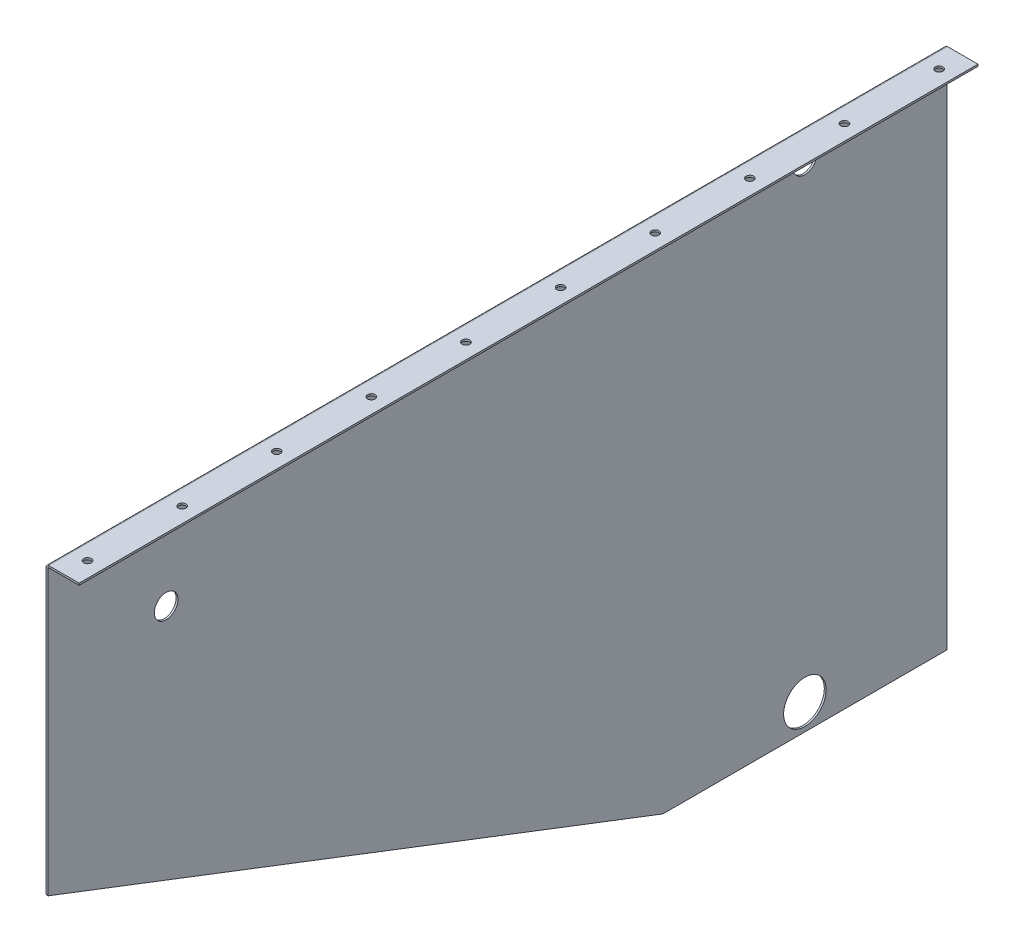
ISO-10303-21;
HEADER;
FILE_DESCRIPTION(('STEP AP214'),'2;1');
FILE_NAME('part.step','',(''),(''),'','','');
FILE_SCHEMA(('AUTOMOTIVE_DESIGN { 1 0 10303 214 1 1 1 1 }'));
ENDSEC;
DATA;
#1=APPLICATION_CONTEXT('core data for automotive mechanical design processes');
#2=APPLICATION_PROTOCOL_DEFINITION('international standard','automotive_design',2000,#1);
#3=PRODUCT_CONTEXT('',#1,'mechanical');
#4=PRODUCT('Part','Part','',(#3));
#5=PRODUCT_RELATED_PRODUCT_CATEGORY('part','',(#4));
#6=PRODUCT_DEFINITION_FORMATION('','',#4);
#7=PRODUCT_DEFINITION_CONTEXT('part definition',#1,'design');
#8=PRODUCT_DEFINITION('design','',#6,#7);
#9=PRODUCT_DEFINITION_SHAPE('','',#8);
#10=(LENGTH_UNIT() NAMED_UNIT(*) SI_UNIT(.MILLI.,.METRE.));
#11=(NAMED_UNIT(*) PLANE_ANGLE_UNIT() SI_UNIT($,.RADIAN.));
#12=(NAMED_UNIT(*) SI_UNIT($,.STERADIAN.) SOLID_ANGLE_UNIT());
#13=UNCERTAINTY_MEASURE_WITH_UNIT(LENGTH_MEASURE(1.E-05),#10,'distance_accuracy_value','');
#14=(GEOMETRIC_REPRESENTATION_CONTEXT(3) GLOBAL_UNCERTAINTY_ASSIGNED_CONTEXT((#13)) GLOBAL_UNIT_ASSIGNED_CONTEXT((#10,
#11,#12)) REPRESENTATION_CONTEXT('',''));
#15=CARTESIAN_POINT('',(0.,0.,0.));
#16=DIRECTION('',(0.,0.,1.));
#17=DIRECTION('',(1.,0.,0.));
#18=AXIS2_PLACEMENT_3D('',#15,#16,#17);
#19=CARTESIAN_POINT('',(-1.99124490111207,2.73660000000006,0.));
#20=DIRECTION('',(0.,-1.,0.));
#21=DIRECTION('',(0.,0.,-1.));
#22=AXIS2_PLACEMENT_3D('',#19,#20,#21);
#23=PLANE('',#22);
#24=CARTESIAN_POINT('',(16.872677549444,2.7366,-24.9999999999999));
#25=DIRECTION('',(0.,-1.,0.));
#26=DIRECTION('',(1.,0.,0.));
#27=AXIS2_PLACEMENT_3D('',#24,#25,#26);
#28=CIRCLE('',#27,4.);
#29=CARTESIAN_POINT('',(20.872677549444,2.73659999999998,-24.9999999999999));
#30=VERTEX_POINT('',#29);
#31=EDGE_CURVE('E217',#30,#30,#28,.T.);
#32=ORIENTED_EDGE('',*,*,#31,.T.);
#33=EDGE_LOOP('',(#32));
#34=FACE_BOUND('',#33,.T.);
#35=CARTESIAN_POINT('',(16.872677549445,2.73659999999999,-125.));
#36=DIRECTION('',(0.,-1.,0.));
#37=DIRECTION('',(1.,0.,0.));
#38=AXIS2_PLACEMENT_3D('',#35,#36,#37);
#39=CIRCLE('',#38,4.);
#40=CARTESIAN_POINT('',(20.872677549445,2.73659999999998,-125.));
#41=VERTEX_POINT('',#40);
#42=EDGE_CURVE('E316',#41,#41,#39,.T.);
#43=ORIENTED_EDGE('',*,*,#42,.T.);
#44=EDGE_LOOP('',(#43));
#45=FACE_BOUND('',#44,.T.);
#46=CARTESIAN_POINT('',(16.872677549446,2.73659999999999,-225.));
#47=DIRECTION('',(0.,-1.,0.));
#48=DIRECTION('',(1.,0.,0.));
#49=AXIS2_PLACEMENT_3D('',#46,#47,#48);
#50=CIRCLE('',#49,4.);
#51=CARTESIAN_POINT('',(20.872677549446,2.73659999999997,-225.));
#52=VERTEX_POINT('',#51);
#53=EDGE_CURVE('E306',#52,#52,#50,.T.);
#54=ORIENTED_EDGE('',*,*,#53,.T.);
#55=EDGE_LOOP('',(#54));
#56=FACE_BOUND('',#55,.T.);
#57=CARTESIAN_POINT('',(16.8726775494471,2.73659999999998,-325.));
#58=DIRECTION('',(0.,-1.,0.));
#59=DIRECTION('',(1.,0.,0.));
#60=AXIS2_PLACEMENT_3D('',#57,#58,#59);
#61=CIRCLE('',#60,4.);
#62=CARTESIAN_POINT('',(20.8726775494471,2.73659999999997,-325.));
#63=VERTEX_POINT('',#62);
#64=EDGE_CURVE('E296',#63,#63,#61,.T.);
#65=ORIENTED_EDGE('',*,*,#64,.T.);
#66=EDGE_LOOP('',(#65));
#67=FACE_BOUND('',#66,.T.);
#68=CARTESIAN_POINT('',(16.8726775494481,2.73659999999997,-425.));
#69=DIRECTION('',(0.,-1.,0.));
#70=DIRECTION('',(1.,0.,0.));
#71=AXIS2_PLACEMENT_3D('',#68,#69,#70);
#72=CIRCLE('',#71,4.);
#73=CARTESIAN_POINT('',(20.8726775494481,2.73659999999996,-425.));
#74=VERTEX_POINT('',#73);
#75=EDGE_CURVE('E286',#74,#74,#72,.T.);
#76=ORIENTED_EDGE('',*,*,#75,.T.);
#77=EDGE_LOOP('',(#76));
#78=FACE_BOUND('',#77,.T.);
#79=CARTESIAN_POINT('',(16.8726775494492,2.73659999999997,-525.));
#80=DIRECTION('',(0.,-1.,0.));
#81=DIRECTION('',(1.,0.,0.));
#82=AXIS2_PLACEMENT_3D('',#79,#80,#81);
#83=CIRCLE('',#82,4.);
#84=CARTESIAN_POINT('',(20.8726775494492,2.73659999999995,-525.));
#85=VERTEX_POINT('',#84);
#86=EDGE_CURVE('E276',#85,#85,#83,.T.);
#87=ORIENTED_EDGE('',*,*,#86,.T.);
#88=EDGE_LOOP('',(#87));
#89=FACE_BOUND('',#88,.T.);
#90=CARTESIAN_POINT('',(16.8726775494502,2.73659999999996,-625.));
#91=DIRECTION('',(0.,-1.,0.));
#92=DIRECTION('',(1.,0.,0.));
#93=AXIS2_PLACEMENT_3D('',#90,#91,#92);
#94=CIRCLE('',#93,4.);
#95=CARTESIAN_POINT('',(20.8726775494502,2.73659999999995,-625.));
#96=VERTEX_POINT('',#95);
#97=EDGE_CURVE('E266',#96,#96,#94,.T.);
#98=ORIENTED_EDGE('',*,*,#97,.T.);
#99=EDGE_LOOP('',(#98));
#100=FACE_BOUND('',#99,.T.);
#101=CARTESIAN_POINT('',(16.8726775494513,2.73659999999996,-725.));
#102=DIRECTION('',(0.,-1.,0.));
#103=DIRECTION('',(1.,0.,0.));
#104=AXIS2_PLACEMENT_3D('',#101,#102,#103);
#105=CIRCLE('',#104,4.);
#106=CARTESIAN_POINT('',(20.8726775494513,2.73659999999994,-725.));
#107=VERTEX_POINT('',#106);
#108=EDGE_CURVE('E256',#107,#107,#105,.T.);
#109=ORIENTED_EDGE('',*,*,#108,.T.);
#110=EDGE_LOOP('',(#109));
#111=FACE_BOUND('',#110,.T.);
#112=CARTESIAN_POINT('',(16.8726775494523,2.73659999999995,-825.));
#113=DIRECTION('',(0.,-1.,0.));
#114=DIRECTION('',(1.,0.,0.));
#115=AXIS2_PLACEMENT_3D('',#112,#113,#114);
#116=CIRCLE('',#115,4.);
#117=CARTESIAN_POINT('',(20.8726775494523,2.73659999999994,-825.));
#118=VERTEX_POINT('',#117);
#119=EDGE_CURVE('E245',#118,#118,#116,.T.);
#120=ORIENTED_EDGE('',*,*,#119,.T.);
#121=EDGE_LOOP('',(#120));
#122=FACE_BOUND('',#121,.T.);
#123=CARTESIAN_POINT('',(16.8726775494533,2.73659999999995,-925.));
#124=DIRECTION('',(0.,-1.,0.));
#125=DIRECTION('',(1.,0.,0.));
#126=AXIS2_PLACEMENT_3D('',#123,#124,#125);
#127=CIRCLE('',#126,4.);
#128=CARTESIAN_POINT('',(20.8726775494533,2.73659999999993,-925.));
#129=VERTEX_POINT('',#128);
#130=EDGE_CURVE('E241',#129,#129,#127,.T.);
#131=ORIENTED_EDGE('',*,*,#130,.T.);
#132=EDGE_LOOP('',(#131));
#133=FACE_BOUND('',#132,.T.);
#134=DIRECTION('',(1.,0.,0.));
#135=VECTOR('',#134,1.);
#136=CARTESIAN_POINT('',(-1.99124490111202,2.73660000000001,-950.));
#137=LINE('',#136,#135);
#138=CARTESIAN_POINT('',(0.736599999999966,2.7366,-950.));
#139=VERTEX_POINT('',#138);
#140=CARTESIAN_POINT('',(33.008755098888,2.73659999999989,-950.));
#141=VERTEX_POINT('',#140);
#142=EDGE_CURVE('E141',#139,#141,#137,.T.);
#143=ORIENTED_EDGE('',*,*,#142,.F.);
#144=DIRECTION('',(0.,0.,1.));
#145=VECTOR('',#144,1.);
#146=CARTESIAN_POINT('',(0.736600000000009,2.73660000000006,0.));
#147=LINE('',#146,#145);
#148=CARTESIAN_POINT('',(0.736600000000009,2.73660000000006,0.));
#149=VERTEX_POINT('',#148);
#150=EDGE_CURVE('E128',#139,#149,#147,.T.);
#151=ORIENTED_EDGE('',*,*,#150,.T.);
#152=DIRECTION('',(-1.,0.,0.));
#153=VECTOR('',#152,1.);
#154=CARTESIAN_POINT('',(-1.99124490111207,2.73660000000006,0.));
#155=LINE('',#154,#153);
#156=CARTESIAN_POINT('',(33.0087550988879,2.73659999999994,0.));
#157=VERTEX_POINT('',#156);
#158=EDGE_CURVE('E159',#157,#149,#155,.T.);
#159=ORIENTED_EDGE('',*,*,#158,.F.);
#160=DIRECTION('',(0.,0.,1.));
#161=VECTOR('',#160,1.);
#162=CARTESIAN_POINT('',(33.0087550988879,2.73659999999994,0.));
#163=LINE('',#162,#161);
#164=EDGE_CURVE('E154',#141,#157,#163,.T.);
#165=ORIENTED_EDGE('',*,*,#164,.F.);
#166=EDGE_LOOP('',(#143,#151,#159,#165));
#167=FACE_BOUND('',#166,.T.);
#168=ADVANCED_FACE('F46',(#34,#45,#56,#67,#78,#89,#100,#111,#122,#133,#167),#23,.F.);
#169=CARTESIAN_POINT('',(-1.99124490111202,2.73660000000001,-950.));
#170=DIRECTION('',(0.,0.,-1.));
#171=DIRECTION('',(0.,1.,0.));
#172=AXIS2_PLACEMENT_3D('',#169,#170,#171);
#173=PLANE('',#172);
#174=DIRECTION('',(0.,-1.,0.));
#175=VECTOR('',#174,1.);
#176=CARTESIAN_POINT('',(0.736600000000009,2.7366,-950.));
#177=LINE('',#176,#175);
#178=CARTESIAN_POINT('',(0.736599999999991,0.7366,-950.));
#179=VERTEX_POINT('',#178);
#180=EDGE_CURVE('E140',#139,#179,#177,.T.);
#181=ORIENTED_EDGE('',*,*,#180,.F.);
#182=ORIENTED_EDGE('',*,*,#142,.T.);
#183=DIRECTION('',(0.,-1.,0.));
#184=VECTOR('',#183,1.);
#185=CARTESIAN_POINT('',(33.008755098888,2.73659999999989,-950.));
#186=LINE('',#185,#184);
#187=CARTESIAN_POINT('',(33.008755098888,0.736599999999887,-950.));
#188=VERTEX_POINT('',#187);
#189=EDGE_CURVE('E398',#141,#188,#186,.T.);
#190=ORIENTED_EDGE('',*,*,#189,.T.);
#191=DIRECTION('',(1.,0.,0.));
#192=VECTOR('',#191,1.);
#193=CARTESIAN_POINT('',(-1.99124490111203,0.736600000000009,-950.));
#194=LINE('',#193,#192);
#195=EDGE_CURVE('E163',#179,#188,#194,.T.);
#196=ORIENTED_EDGE('',*,*,#195,.F.);
#197=EDGE_LOOP('',(#181,#182,#190,#196));
#198=FACE_BOUND('',#197,.T.);
#199=ADVANCED_FACE('F162',(#198),#173,.T.);
#200=CARTESIAN_POINT('',(-1.99124490111207,2.73660000000006,0.));
#201=DIRECTION('',(0.,0.,1.));
#202=DIRECTION('',(-1.,0.,0.));
#203=AXIS2_PLACEMENT_3D('',#200,#201,#202);
#204=PLANE('',#203);
#205=DIRECTION('',(0.,1.,0.));
#206=VECTOR('',#205,1.);
#207=CARTESIAN_POINT('',(0.736600000000009,2.73660000000006,0.));
#208=LINE('',#207,#206);
#209=CARTESIAN_POINT('',(0.736599999999991,0.736600000000056,0.));
#210=VERTEX_POINT('',#209);
#211=EDGE_CURVE('E172',#210,#149,#208,.T.);
#212=ORIENTED_EDGE('',*,*,#211,.F.);
#213=DIRECTION('',(-1.,0.,0.));
#214=VECTOR('',#213,1.);
#215=CARTESIAN_POINT('',(-1.99124490111208,0.736600000000065,0.));
#216=LINE('',#215,#214);
#217=CARTESIAN_POINT('',(33.0087550988879,0.736599999999942,0.));
#218=VERTEX_POINT('',#217);
#219=EDGE_CURVE('E181',#218,#210,#216,.T.);
#220=ORIENTED_EDGE('',*,*,#219,.F.);
#221=DIRECTION('',(0.,-1.,0.));
#222=VECTOR('',#221,1.);
#223=CARTESIAN_POINT('',(33.0087550988879,2.73659999999994,0.));
#224=LINE('',#223,#222);
#225=EDGE_CURVE('E185',#157,#218,#224,.T.);
#226=ORIENTED_EDGE('',*,*,#225,.F.);
#227=ORIENTED_EDGE('',*,*,#158,.T.);
#228=EDGE_LOOP('',(#212,#220,#226,#227));
#229=FACE_BOUND('',#228,.T.);
#230=ADVANCED_FACE('F458',(#229),#204,.T.);
#231=CARTESIAN_POINT('',(-1.99124490111208,0.736600000000065,0.));
#232=DIRECTION('',(0.,-1.,0.));
#233=DIRECTION('',(0.,0.,-1.));
#234=AXIS2_PLACEMENT_3D('',#231,#232,#233);
#235=PLANE('',#234);
#236=CARTESIAN_POINT('',(16.872677549444,0.736599999999997,-24.9999999999999));
#237=DIRECTION('',(0.,-1.,0.));
#238=DIRECTION('',(1.,0.,0.));
#239=AXIS2_PLACEMENT_3D('',#236,#237,#238);
#240=CIRCLE('',#239,4.);
#241=CARTESIAN_POINT('',(20.872677549444,0.736599999999983,-24.9999999999999));
#242=VERTEX_POINT('',#241);
#243=EDGE_CURVE('E246',#242,#242,#240,.T.);
#244=ORIENTED_EDGE('',*,*,#243,.F.);
#245=EDGE_LOOP('',(#244));
#246=FACE_BOUND('',#245,.T.);
#247=CARTESIAN_POINT('',(16.872677549445,0.736599999999991,-125.));
#248=DIRECTION('',(0.,-1.,0.));
#249=DIRECTION('',(1.,0.,0.));
#250=AXIS2_PLACEMENT_3D('',#247,#248,#249);
#251=CIRCLE('',#250,4.);
#252=CARTESIAN_POINT('',(20.872677549445,0.736599999999977,-125.));
#253=VERTEX_POINT('',#252);
#254=EDGE_CURVE('E311',#253,#253,#251,.T.);
#255=ORIENTED_EDGE('',*,*,#254,.F.);
#256=EDGE_LOOP('',(#255));
#257=FACE_BOUND('',#256,.T.);
#258=CARTESIAN_POINT('',(16.872677549446,0.736599999999986,-225.));
#259=DIRECTION('',(0.,-1.,0.));
#260=DIRECTION('',(1.,0.,0.));
#261=AXIS2_PLACEMENT_3D('',#258,#259,#260);
#262=CIRCLE('',#261,4.);
#263=CARTESIAN_POINT('',(20.872677549446,0.736599999999972,-225.));
#264=VERTEX_POINT('',#263);
#265=EDGE_CURVE('E301',#264,#264,#262,.T.);
#266=ORIENTED_EDGE('',*,*,#265,.F.);
#267=EDGE_LOOP('',(#266));
#268=FACE_BOUND('',#267,.T.);
#269=CARTESIAN_POINT('',(16.8726775494471,0.73659999999998,-325.));
#270=DIRECTION('',(0.,-1.,0.));
#271=DIRECTION('',(1.,0.,0.));
#272=AXIS2_PLACEMENT_3D('',#269,#270,#271);
#273=CIRCLE('',#272,4.);
#274=CARTESIAN_POINT('',(20.8726775494471,0.736599999999966,-325.));
#275=VERTEX_POINT('',#274);
#276=EDGE_CURVE('E291',#275,#275,#273,.T.);
#277=ORIENTED_EDGE('',*,*,#276,.F.);
#278=EDGE_LOOP('',(#277));
#279=FACE_BOUND('',#278,.T.);
#280=CARTESIAN_POINT('',(16.8726775494481,0.736599999999974,-425.));
#281=DIRECTION('',(0.,-1.,0.));
#282=DIRECTION('',(1.,0.,0.));
#283=AXIS2_PLACEMENT_3D('',#280,#281,#282);
#284=CIRCLE('',#283,4.);
#285=CARTESIAN_POINT('',(20.8726775494481,0.73659999999996,-425.));
#286=VERTEX_POINT('',#285);
#287=EDGE_CURVE('E281',#286,#286,#284,.T.);
#288=ORIENTED_EDGE('',*,*,#287,.F.);
#289=EDGE_LOOP('',(#288));
#290=FACE_BOUND('',#289,.T.);
#291=CARTESIAN_POINT('',(16.8726775494492,0.736599999999968,-525.));
#292=DIRECTION('',(0.,-1.,0.));
#293=DIRECTION('',(1.,0.,0.));
#294=AXIS2_PLACEMENT_3D('',#291,#292,#293);
#295=CIRCLE('',#294,4.);
#296=CARTESIAN_POINT('',(20.8726775494492,0.736599999999954,-525.));
#297=VERTEX_POINT('',#296);
#298=EDGE_CURVE('E271',#297,#297,#295,.T.);
#299=ORIENTED_EDGE('',*,*,#298,.F.);
#300=EDGE_LOOP('',(#299));
#301=FACE_BOUND('',#300,.T.);
#302=CARTESIAN_POINT('',(16.8726775494502,0.736599999999962,-625.));
#303=DIRECTION('',(0.,-1.,0.));
#304=DIRECTION('',(1.,0.,0.));
#305=AXIS2_PLACEMENT_3D('',#302,#303,#304);
#306=CIRCLE('',#305,4.);
#307=CARTESIAN_POINT('',(20.8726775494502,0.736599999999948,-625.));
#308=VERTEX_POINT('',#307);
#309=EDGE_CURVE('E261',#308,#308,#306,.T.);
#310=ORIENTED_EDGE('',*,*,#309,.F.);
#311=EDGE_LOOP('',(#310));
#312=FACE_BOUND('',#311,.T.);
#313=CARTESIAN_POINT('',(16.8726775494513,0.736599999999956,-725.));
#314=DIRECTION('',(0.,-1.,0.));
#315=DIRECTION('',(1.,0.,0.));
#316=AXIS2_PLACEMENT_3D('',#313,#314,#315);
#317=CIRCLE('',#316,4.);
#318=CARTESIAN_POINT('',(20.8726775494513,0.736599999999942,-725.));
#319=VERTEX_POINT('',#318);
#320=EDGE_CURVE('E251',#319,#319,#317,.T.);
#321=ORIENTED_EDGE('',*,*,#320,.F.);
#322=EDGE_LOOP('',(#321));
#323=FACE_BOUND('',#322,.T.);
#324=CARTESIAN_POINT('',(16.8726775494523,0.736599999999951,-825.));
#325=DIRECTION('',(0.,-1.,0.));
#326=DIRECTION('',(1.,0.,0.));
#327=AXIS2_PLACEMENT_3D('',#324,#325,#326);
#328=CIRCLE('',#327,4.);
#329=CARTESIAN_POINT('',(20.8726775494523,0.736599999999937,-825.));
#330=VERTEX_POINT('',#329);
#331=EDGE_CURVE('E238',#330,#330,#328,.T.);
#332=ORIENTED_EDGE('',*,*,#331,.F.);
#333=EDGE_LOOP('',(#332));
#334=FACE_BOUND('',#333,.T.);
#335=CARTESIAN_POINT('',(16.8726775494533,0.736599999999945,-925.));
#336=DIRECTION('',(0.,-1.,0.));
#337=DIRECTION('',(1.,0.,0.));
#338=AXIS2_PLACEMENT_3D('',#335,#336,#337);
#339=CIRCLE('',#338,4.);
#340=CARTESIAN_POINT('',(20.8726775494533,0.736599999999931,-925.));
#341=VERTEX_POINT('',#340);
#342=EDGE_CURVE('E234',#341,#341,#339,.T.);
#343=ORIENTED_EDGE('',*,*,#342,.F.);
#344=EDGE_LOOP('',(#343));
#345=FACE_BOUND('',#344,.T.);
#346=DIRECTION('',(0.,0.,1.));
#347=VECTOR('',#346,1.);
#348=CARTESIAN_POINT('',(0.736600000000002,0.736600000000055,0.));
#349=LINE('',#348,#347);
#350=EDGE_CURVE('E166',#179,#210,#349,.T.);
#351=ORIENTED_EDGE('',*,*,#350,.F.);
#352=ORIENTED_EDGE('',*,*,#195,.T.);
#353=DIRECTION('',(0.,0.,1.));
#354=VECTOR('',#353,1.);
#355=CARTESIAN_POINT('',(33.0087550988879,0.736599999999942,0.));
#356=LINE('',#355,#354);
#357=EDGE_CURVE('E355',#188,#218,#356,.T.);
#358=ORIENTED_EDGE('',*,*,#357,.T.);
#359=ORIENTED_EDGE('',*,*,#219,.T.);
#360=EDGE_LOOP('',(#351,#352,#358,#359));
#361=FACE_BOUND('',#360,.T.);
#362=ADVANCED_FACE('F411',(#246,#257,#268,#279,#290,#301,#312,#323,#334,#345,#361),#235,.T.);
#363=CARTESIAN_POINT('',(33.0087550988879,2.73659999999994,0.));
#364=DIRECTION('',(1.,0.,0.));
#365=DIRECTION('',(0.,0.,1.));
#366=AXIS2_PLACEMENT_3D('',#363,#364,#365);
#367=PLANE('',#366);
#368=ORIENTED_EDGE('',*,*,#357,.F.);
#369=ORIENTED_EDGE('',*,*,#189,.F.);
#370=ORIENTED_EDGE('',*,*,#164,.T.);
#371=ORIENTED_EDGE('',*,*,#225,.T.);
#372=EDGE_LOOP('',(#368,#369,#370,#371));
#373=FACE_BOUND('',#372,.T.);
#374=ADVANCED_FACE('F408',(#373),#367,.T.);
#375=CARTESIAN_POINT('',(-2.,-300.,0.));
#376=DIRECTION('',(0.,-0.93334560620306,0.358979079308869));
#377=DIRECTION('',(0.,-0.358979079308869,-0.93334560620306));
#378=AXIS2_PLACEMENT_3D('',#375,#376,#377);
#379=PLANE('',#378);
#380=DIRECTION('',(0.,-0.358979079308869,-0.93334560620306));
#381=VECTOR('',#380,1.);
#382=CARTESIAN_POINT('',(-2.,-300.,0.));
#383=LINE('',#382,#381);
#384=CARTESIAN_POINT('',(-2.,-300.192306276207,-0.499996318139134));
#385=VERTEX_POINT('',#384);
#386=CARTESIAN_POINT('',(-2.,-549.950675748591,-649.871756946335));
#387=VERTEX_POINT('',#386);
#388=EDGE_CURVE('E390',#385,#387,#383,.T.);
#389=ORIENTED_EDGE('',*,*,#388,.T.);
#390=DIRECTION('',(1.,0.,0.));
#391=VECTOR('',#390,1.);
#392=CARTESIAN_POINT('',(-2.,-549.950675748591,-649.871756946335));
#393=LINE('',#392,#391);
#394=CARTESIAN_POINT('',(0.,-549.950675748591,-649.871756946335));
#395=VERTEX_POINT('',#394);
#396=EDGE_CURVE('E200',#387,#395,#393,.T.);
#397=ORIENTED_EDGE('',*,*,#396,.T.);
#398=DIRECTION('',(0.,-0.358979079308869,-0.93334560620306));
#399=VECTOR('',#398,1.);
#400=CARTESIAN_POINT('',(0.,-300.,0.));
#401=LINE('',#400,#399);
#402=CARTESIAN_POINT('',(0.,-300.192306276207,-0.499996318139134));
#403=VERTEX_POINT('',#402);
#404=EDGE_CURVE('E363',#403,#395,#401,.T.);
#405=ORIENTED_EDGE('',*,*,#404,.F.);
#406=DIRECTION('',(1.,0.,0.));
#407=VECTOR('',#406,1.);
#408=CARTESIAN_POINT('',(-2.,-300.192306276207,-0.499996318139126));
#409=LINE('',#408,#407);
#410=EDGE_CURVE('E194',#403,#385,#409,.F.);
#411=ORIENTED_EDGE('',*,*,#410,.T.);
#412=EDGE_LOOP('',(#389,#397,#405,#411));
#413=FACE_BOUND('',#412,.T.);
#414=ADVANCED_FACE('F440',(#413),#379,.T.);
#415=CARTESIAN_POINT('',(-2.,-550.,-950.));
#416=DIRECTION('',(0.,-1.,0.));
#417=DIRECTION('',(0.,0.,-1.));
#418=AXIS2_PLACEMENT_3D('',#415,#416,#417);
#419=PLANE('',#418);
#420=DIRECTION('',(0.,0.,-1.));
#421=VECTOR('',#420,1.);
#422=CARTESIAN_POINT('',(0.,-550.,-950.));
#423=LINE('',#422,#421);
#424=CARTESIAN_POINT('',(0.,-550.,-650.137401465024));
#425=VERTEX_POINT('',#424);
#426=CARTESIAN_POINT('',(0.,-550.,-950.));
#427=VERTEX_POINT('',#426);
#428=EDGE_CURVE('E360',#425,#427,#423,.T.);
#429=ORIENTED_EDGE('',*,*,#428,.F.);
#430=DIRECTION('',(1.,0.,0.));
#431=VECTOR('',#430,1.);
#432=CARTESIAN_POINT('',(-2.,-550.,-650.137401465024));
#433=LINE('',#432,#431);
#434=CARTESIAN_POINT('',(-2.,-550.,-650.137401465024));
#435=VERTEX_POINT('',#434);
#436=EDGE_CURVE('E55',#425,#435,#433,.F.);
#437=ORIENTED_EDGE('',*,*,#436,.T.);
#438=DIRECTION('',(0.,0.,-1.));
#439=VECTOR('',#438,1.);
#440=CARTESIAN_POINT('',(-2.,-550.,-950.));
#441=LINE('',#440,#439);
#442=CARTESIAN_POINT('',(-2.,-550.,-950.));
#443=VERTEX_POINT('',#442);
#444=EDGE_CURVE('E388',#435,#443,#441,.T.);
#445=ORIENTED_EDGE('',*,*,#444,.T.);
#446=DIRECTION('',(1.,0.,0.));
#447=VECTOR('',#446,1.);
#448=CARTESIAN_POINT('',(-2.,-550.,-950.));
#449=LINE('',#448,#447);
#450=EDGE_CURVE('E384',#443,#427,#449,.T.);
#451=ORIENTED_EDGE('',*,*,#450,.T.);
#452=EDGE_LOOP('',(#429,#437,#445,#451));
#453=FACE_BOUND('',#452,.T.);
#454=ADVANCED_FACE('F490',(#453),#419,.T.);
#455=CARTESIAN_POINT('',(-2.,0.,0.));
#456=DIRECTION('',(1.,0.,0.));
#457=DIRECTION('',(0.,0.,-1.));
#458=AXIS2_PLACEMENT_3D('',#455,#456,#457);
#459=PLANE('',#458);
#460=CARTESIAN_POINT('',(-2.,-97.2634000000001,-125.));
#461=DIRECTION('',(1.,0.,0.));
#462=DIRECTION('',(0.,0.,-1.));
#463=AXIS2_PLACEMENT_3D('',#460,#461,#462);
#464=CIRCLE('',#463,12.5);
#465=CARTESIAN_POINT('',(-2.,-97.2634000000001,-137.5));
#466=VERTEX_POINT('',#465);
#467=EDGE_CURVE('E239',#466,#466,#464,.T.);
#468=ORIENTED_EDGE('',*,*,#467,.T.);
#469=EDGE_LOOP('',(#468));
#470=FACE_BOUND('',#469,.T.);
#471=CARTESIAN_POINT('',(-2.,-27.5,-800.068700732512));
#472=DIRECTION('',(1.,0.,0.));
#473=DIRECTION('',(0.,0.,-1.));
#474=AXIS2_PLACEMENT_3D('',#471,#472,#473);
#475=CIRCLE('',#474,12.5);
#476=CARTESIAN_POINT('',(-2.,-27.5,-812.568700732512));
#477=VERTEX_POINT('',#476);
#478=EDGE_CURVE('E223',#477,#477,#475,.T.);
#479=ORIENTED_EDGE('',*,*,#478,.T.);
#480=EDGE_LOOP('',(#479));
#481=FACE_BOUND('',#480,.T.);
#482=CARTESIAN_POINT('',(-2.,-522.5,-800.068700732512));
#483=DIRECTION('',(1.,0.,0.));
#484=DIRECTION('',(0.,0.,-1.));
#485=AXIS2_PLACEMENT_3D('',#482,#483,#484);
#486=CIRCLE('',#485,22.5);
#487=CARTESIAN_POINT('',(-2.,-522.5,-822.568700732512));
#488=VERTEX_POINT('',#487);
#489=EDGE_CURVE('E219',#488,#488,#486,.T.);
#490=ORIENTED_EDGE('',*,*,#489,.T.);
#491=EDGE_LOOP('',(#490));
#492=FACE_BOUND('',#491,.T.);
#493=ORIENTED_EDGE('',*,*,#444,.F.);
#494=CARTESIAN_POINT('',(-2.,-549.26,-650.137401465024));
#495=DIRECTION('',(1.,0.,0.));
#496=DIRECTION('',(0.,0.,-1.));
#497=AXIS2_PLACEMENT_3D('',#494,#495,#496);
#498=CIRCLE('',#497,0.74);
#499=EDGE_CURVE('E12',#435,#387,#498,.F.);
#500=ORIENTED_EDGE('',*,*,#499,.T.);
#501=ORIENTED_EDGE('',*,*,#388,.F.);
#502=CARTESIAN_POINT('',(-2.,-299.464296703369,-0.780000000000037));
#503=DIRECTION('',(1.,0.,0.));
#504=DIRECTION('',(0.,0.,-1.));
#505=AXIS2_PLACEMENT_3D('',#502,#503,#504);
#506=CIRCLE('',#505,0.78);
#507=CARTESIAN_POINT('',(-2.,-299.464296703369,0.));
#508=VERTEX_POINT('',#507);
#509=EDGE_CURVE('E197',#385,#508,#506,.F.);
#510=ORIENTED_EDGE('',*,*,#509,.T.);
#511=DIRECTION('',(0.,-1.,0.));
#512=VECTOR('',#511,1.);
#513=CARTESIAN_POINT('',(-2.,0.,0.));
#514=LINE('',#513,#512);
#515=CARTESIAN_POINT('',(-2.,0.,0.));
#516=VERTEX_POINT('',#515);
#517=EDGE_CURVE('E352',#516,#508,#514,.T.);
#518=ORIENTED_EDGE('',*,*,#517,.F.);
#519=DIRECTION('',(0.,0.,1.));
#520=VECTOR('',#519,1.);
#521=CARTESIAN_POINT('',(-2.,0.,0.));
#522=LINE('',#521,#520);
#523=CARTESIAN_POINT('',(-2.,0.,-950.));
#524=VERTEX_POINT('',#523);
#525=EDGE_CURVE('E347',#524,#516,#522,.T.);
#526=ORIENTED_EDGE('',*,*,#525,.F.);
#527=DIRECTION('',(0.,1.,0.));
#528=VECTOR('',#527,1.);
#529=CARTESIAN_POINT('',(-2.,0.,-950.));
#530=LINE('',#529,#528);
#531=EDGE_CURVE('E380',#443,#524,#530,.T.);
#532=ORIENTED_EDGE('',*,*,#531,.F.);
#533=EDGE_LOOP('',(#493,#500,#501,#510,#518,#526,#532));
#534=FACE_BOUND('',#533,.T.);
#535=ADVANCED_FACE('F431',(#470,#481,#492,#534),#459,.F.);
#536=CARTESIAN_POINT('',(-2.,0.,-950.));
#537=DIRECTION('',(0.,0.,-1.));
#538=DIRECTION('',(-1.,0.,0.));
#539=AXIS2_PLACEMENT_3D('',#536,#537,#538);
#540=PLANE('',#539);
#541=ORIENTED_EDGE('',*,*,#531,.T.);
#542=DIRECTION('',(1.,0.,0.));
#543=VECTOR('',#542,1.);
#544=CARTESIAN_POINT('',(-2.,0.,-950.));
#545=LINE('',#544,#543);
#546=CARTESIAN_POINT('',(0.,0.,-950.));
#547=VERTEX_POINT('',#546);
#548=EDGE_CURVE('E148',#524,#547,#545,.T.);
#549=ORIENTED_EDGE('',*,*,#548,.T.);
#550=DIRECTION('',(0.,1.,0.));
#551=VECTOR('',#550,1.);
#552=CARTESIAN_POINT('',(0.,0.,-950.));
#553=LINE('',#552,#551);
#554=EDGE_CURVE('E374',#427,#547,#553,.T.);
#555=ORIENTED_EDGE('',*,*,#554,.F.);
#556=ORIENTED_EDGE('',*,*,#450,.F.);
#557=EDGE_LOOP('',(#541,#549,#555,#556));
#558=FACE_BOUND('',#557,.T.);
#559=ADVANCED_FACE('F428',(#558),#540,.T.);
#560=CARTESIAN_POINT('',(0.,0.,0.));
#561=DIRECTION('',(1.,0.,0.));
#562=DIRECTION('',(0.,0.,-1.));
#563=AXIS2_PLACEMENT_3D('',#560,#561,#562);
#564=PLANE('',#563);
#565=CARTESIAN_POINT('',(0.,-97.2634000000001,-125.));
#566=DIRECTION('',(1.,0.,0.));
#567=DIRECTION('',(0.,0.,-1.));
#568=AXIS2_PLACEMENT_3D('',#565,#566,#567);
#569=CIRCLE('',#568,12.5);
#570=CARTESIAN_POINT('',(0.,-97.2634000000001,-137.5));
#571=VERTEX_POINT('',#570);
#572=EDGE_CURVE('E334',#571,#571,#569,.T.);
#573=ORIENTED_EDGE('',*,*,#572,.F.);
#574=EDGE_LOOP('',(#573));
#575=FACE_BOUND('',#574,.T.);
#576=CARTESIAN_POINT('',(0.,-27.5,-800.068700732512));
#577=DIRECTION('',(1.,0.,0.));
#578=DIRECTION('',(0.,0.,-1.));
#579=AXIS2_PLACEMENT_3D('',#576,#577,#578);
#580=CIRCLE('',#579,12.5);
#581=CARTESIAN_POINT('',(0.,-27.5,-812.568700732512));
#582=VERTEX_POINT('',#581);
#583=EDGE_CURVE('E216',#582,#582,#580,.T.);
#584=ORIENTED_EDGE('',*,*,#583,.F.);
#585=EDGE_LOOP('',(#584));
#586=FACE_BOUND('',#585,.T.);
#587=CARTESIAN_POINT('',(0.,-522.5,-800.068700732512));
#588=DIRECTION('',(1.,0.,0.));
#589=DIRECTION('',(0.,0.,-1.));
#590=AXIS2_PLACEMENT_3D('',#587,#588,#589);
#591=CIRCLE('',#590,22.5);
#592=CARTESIAN_POINT('',(0.,-522.5,-822.568700732512));
#593=VERTEX_POINT('',#592);
#594=EDGE_CURVE('E212',#593,#593,#591,.T.);
#595=ORIENTED_EDGE('',*,*,#594,.F.);
#596=EDGE_LOOP('',(#595));
#597=FACE_BOUND('',#596,.T.);
#598=ORIENTED_EDGE('',*,*,#404,.T.);
#599=CARTESIAN_POINT('',(0.,-549.26,-650.137401465024));
#600=DIRECTION('',(1.,0.,0.));
#601=DIRECTION('',(0.,0.,-1.));
#602=AXIS2_PLACEMENT_3D('',#599,#600,#601);
#603=CIRCLE('',#602,0.74);
#604=EDGE_CURVE('E69',#395,#425,#603,.T.);
#605=ORIENTED_EDGE('',*,*,#604,.T.);
#606=ORIENTED_EDGE('',*,*,#428,.T.);
#607=ORIENTED_EDGE('',*,*,#554,.T.);
#608=DIRECTION('',(0.,0.,1.));
#609=VECTOR('',#608,1.);
#610=CARTESIAN_POINT('',(0.,0.,0.));
#611=LINE('',#610,#609);
#612=CARTESIAN_POINT('',(0.,0.,0.));
#613=VERTEX_POINT('',#612);
#614=EDGE_CURVE('E370',#547,#613,#611,.T.);
#615=ORIENTED_EDGE('',*,*,#614,.T.);
#616=DIRECTION('',(0.,-1.,0.));
#617=VECTOR('',#616,1.);
#618=CARTESIAN_POINT('',(0.,0.,0.));
#619=LINE('',#618,#617);
#620=CARTESIAN_POINT('',(0.,-299.464296703369,0.));
#621=VERTEX_POINT('',#620);
#622=EDGE_CURVE('E366',#613,#621,#619,.T.);
#623=ORIENTED_EDGE('',*,*,#622,.T.);
#624=CARTESIAN_POINT('',(0.,-299.464296703369,-0.780000000000037));
#625=DIRECTION('',(1.,0.,0.));
#626=DIRECTION('',(0.,0.,-1.));
#627=AXIS2_PLACEMENT_3D('',#624,#625,#626);
#628=CIRCLE('',#627,0.78);
#629=EDGE_CURVE('E191',#621,#403,#628,.T.);
#630=ORIENTED_EDGE('',*,*,#629,.T.);
#631=EDGE_LOOP('',(#598,#605,#606,#607,#615,#623,#630));
#632=FACE_BOUND('',#631,.T.);
#633=ADVANCED_FACE('F424',(#575,#586,#597,#632),#564,.T.);
#634=CARTESIAN_POINT('',(-2.,0.,0.));
#635=DIRECTION('',(0.,0.,1.));
#636=DIRECTION('',(0.,-1.,0.));
#637=AXIS2_PLACEMENT_3D('',#634,#635,#636);
#638=PLANE('',#637);
#639=ORIENTED_EDGE('',*,*,#517,.T.);
#640=DIRECTION('',(1.,0.,0.));
#641=VECTOR('',#640,1.);
#642=CARTESIAN_POINT('',(-2.,-299.464296703369,0.));
#643=LINE('',#642,#641);
#644=EDGE_CURVE('E178',#508,#621,#643,.T.);
#645=ORIENTED_EDGE('',*,*,#644,.T.);
#646=ORIENTED_EDGE('',*,*,#622,.F.);
#647=DIRECTION('',(-1.,0.,0.));
#648=VECTOR('',#647,1.);
#649=CARTESIAN_POINT('',(-2.,0.,0.));
#650=LINE('',#649,#648);
#651=EDGE_CURVE('E356',#613,#516,#650,.T.);
#652=ORIENTED_EDGE('',*,*,#651,.T.);
#653=EDGE_LOOP('',(#639,#645,#646,#652));
#654=FACE_BOUND('',#653,.T.);
#655=ADVANCED_FACE('F422',(#654),#638,.T.);
#656=CARTESIAN_POINT('',(0.7366,0.,-950.));
#657=DIRECTION('',(0.,0.,-1.));
#658=DIRECTION('',(-1.,0.,0.));
#659=AXIS2_PLACEMENT_3D('',#656,#657,#658);
#660=PLANE('',#659);
#661=ORIENTED_EDGE('',*,*,#180,.T.);
#662=CARTESIAN_POINT('',(0.7366,0.,-950.));
#663=DIRECTION('',(0.,0.,-1.));
#664=DIRECTION('',(0.,1.,0.));
#665=AXIS2_PLACEMENT_3D('',#662,#663,#664);
#666=CIRCLE('',#665,0.7366);
#667=EDGE_CURVE('E232',#179,#547,#666,.F.);
#668=ORIENTED_EDGE('',*,*,#667,.T.);
#669=ORIENTED_EDGE('',*,*,#548,.F.);
#670=CARTESIAN_POINT('',(0.7366,0.,-950.));
#671=DIRECTION('',(0.,0.,1.));
#672=DIRECTION('',(-1.,0.,0.));
#673=AXIS2_PLACEMENT_3D('',#670,#671,#672);
#674=CIRCLE('',#673,2.7366);
#675=EDGE_CURVE('E131',#139,#524,#674,.T.);
#676=ORIENTED_EDGE('',*,*,#675,.F.);
#677=EDGE_LOOP('',(#661,#668,#669,#676));
#678=FACE_BOUND('',#677,.T.);
#679=ADVANCED_FACE('F144',(#678),#660,.T.);
#680=CARTESIAN_POINT('',(0.7366,0.,0.));
#681=DIRECTION('',(0.,0.,1.));
#682=DIRECTION('',(0.,-1.,0.));
#683=AXIS2_PLACEMENT_3D('',#680,#681,#682);
#684=PLANE('',#683);
#685=CARTESIAN_POINT('',(0.7366,0.,0.));
#686=DIRECTION('',(0.,0.,-1.));
#687=DIRECTION('',(0.,1.,0.));
#688=AXIS2_PLACEMENT_3D('',#685,#686,#687);
#689=CIRCLE('',#688,0.7366);
#690=EDGE_CURVE('E150',#613,#210,#689,.T.);
#691=ORIENTED_EDGE('',*,*,#690,.T.);
#692=ORIENTED_EDGE('',*,*,#211,.T.);
#693=CARTESIAN_POINT('',(0.7366,0.,0.));
#694=DIRECTION('',(0.,0.,-1.));
#695=DIRECTION('',(0.,-1.,0.));
#696=AXIS2_PLACEMENT_3D('',#693,#694,#695);
#697=CIRCLE('',#696,2.7366);
#698=EDGE_CURVE('E134',#516,#149,#697,.T.);
#699=ORIENTED_EDGE('',*,*,#698,.F.);
#700=ORIENTED_EDGE('',*,*,#651,.F.);
#701=EDGE_LOOP('',(#691,#692,#699,#700));
#702=FACE_BOUND('',#701,.T.);
#703=ADVANCED_FACE('F419',(#702),#684,.T.);
#704=CARTESIAN_POINT('',(0.7366,0.,475.006021632392));
#705=DIRECTION('',(0.,0.,-1.));
#706=DIRECTION('',(0.,1.,0.));
#707=AXIS2_PLACEMENT_3D('',#704,#705,#706);
#708=CYLINDRICAL_SURFACE('',#707,2.7366);
#709=ORIENTED_EDGE('',*,*,#525,.T.);
#710=ORIENTED_EDGE('',*,*,#698,.T.);
#711=ORIENTED_EDGE('',*,*,#150,.F.);
#712=ORIENTED_EDGE('',*,*,#675,.T.);
#713=EDGE_LOOP('',(#709,#710,#711,#712));
#714=FACE_BOUND('',#713,.T.);
#715=ADVANCED_FACE('F130',(#714),#708,.T.);
#716=CARTESIAN_POINT('',(0.7366,0.,475.006021632392));
#717=DIRECTION('',(0.,0.,-1.));
#718=DIRECTION('',(0.,1.,0.));
#719=AXIS2_PLACEMENT_3D('',#716,#717,#718);
#720=CYLINDRICAL_SURFACE('',#719,0.7366);
#721=ORIENTED_EDGE('',*,*,#614,.F.);
#722=ORIENTED_EDGE('',*,*,#667,.F.);
#723=ORIENTED_EDGE('',*,*,#350,.T.);
#724=ORIENTED_EDGE('',*,*,#690,.F.);
#725=EDGE_LOOP('',(#721,#722,#723,#724));
#726=FACE_BOUND('',#725,.T.);
#727=ADVANCED_FACE('F416',(#726),#720,.F.);
#728=CARTESIAN_POINT('',(-2.,-299.464296703369,-0.780000000000037));
#729=DIRECTION('',(1.,0.,0.));
#730=DIRECTION('',(0.,0.,-1.));
#731=AXIS2_PLACEMENT_3D('',#728,#729,#730);
#732=CYLINDRICAL_SURFACE('',#731,0.78);
#733=ORIENTED_EDGE('',*,*,#509,.F.);
#734=ORIENTED_EDGE('',*,*,#410,.F.);
#735=ORIENTED_EDGE('',*,*,#629,.F.);
#736=ORIENTED_EDGE('',*,*,#644,.F.);
#737=EDGE_LOOP('',(#733,#734,#735,#736));
#738=FACE_BOUND('',#737,.T.);
#739=ADVANCED_FACE('F437',(#738),#732,.T.);
#740=CARTESIAN_POINT('',(-2.,-549.26,-650.137401465024));
#741=DIRECTION('',(1.,0.,0.));
#742=DIRECTION('',(0.,0.,-1.));
#743=AXIS2_PLACEMENT_3D('',#740,#741,#742);
#744=CYLINDRICAL_SURFACE('',#743,0.74);
#745=ORIENTED_EDGE('',*,*,#499,.F.);
#746=ORIENTED_EDGE('',*,*,#436,.F.);
#747=ORIENTED_EDGE('',*,*,#604,.F.);
#748=ORIENTED_EDGE('',*,*,#396,.F.);
#749=EDGE_LOOP('',(#745,#746,#747,#748));
#750=FACE_BOUND('',#749,.T.);
#751=ADVANCED_FACE('F48',(#750),#744,.T.);
#752=CARTESIAN_POINT('',(-3.,-522.5,-800.068700732512));
#753=DIRECTION('',(1.,0.,0.));
#754=DIRECTION('',(0.,0.,-1.));
#755=AXIS2_PLACEMENT_3D('',#752,#753,#754);
#756=CYLINDRICAL_SURFACE('',#755,22.5);
#757=ORIENTED_EDGE('',*,*,#594,.T.);
#758=EDGE_LOOP('',(#757));
#759=FACE_BOUND('',#758,.T.);
#760=ORIENTED_EDGE('',*,*,#489,.F.);
#761=EDGE_LOOP('',(#760));
#762=FACE_BOUND('',#761,.T.);
#763=ADVANCED_FACE('F444',(#759,#762),#756,.F.);
#764=CARTESIAN_POINT('',(-3.,-27.5,-800.068700732512));
#765=DIRECTION('',(1.,0.,0.));
#766=DIRECTION('',(0.,0.,-1.));
#767=AXIS2_PLACEMENT_3D('',#764,#765,#766);
#768=CYLINDRICAL_SURFACE('',#767,12.5);
#769=ORIENTED_EDGE('',*,*,#583,.T.);
#770=EDGE_LOOP('',(#769));
#771=FACE_BOUND('',#770,.T.);
#772=ORIENTED_EDGE('',*,*,#478,.F.);
#773=EDGE_LOOP('',(#772));
#774=FACE_BOUND('',#773,.T.);
#775=ADVANCED_FACE('F449',(#771,#774),#768,.F.);
#776=CARTESIAN_POINT('',(16.8726775494533,3.73659999999995,-925.));
#777=DIRECTION('',(0.,-1.,0.));
#778=DIRECTION('',(1.,0.,0.));
#779=AXIS2_PLACEMENT_3D('',#776,#777,#778);
#780=CYLINDRICAL_SURFACE('',#779,4.);
#781=ORIENTED_EDGE('',*,*,#342,.T.);
#782=EDGE_LOOP('',(#781));
#783=FACE_BOUND('',#782,.T.);
#784=ORIENTED_EDGE('',*,*,#130,.F.);
#785=EDGE_LOOP('',(#784));
#786=FACE_BOUND('',#785,.T.);
#787=ADVANCED_FACE('F580',(#783,#786),#780,.F.);
#788=CARTESIAN_POINT('',(16.8726775494523,3.73659999999995,-825.));
#789=DIRECTION('',(0.,-1.,0.));
#790=DIRECTION('',(1.,0.,0.));
#791=AXIS2_PLACEMENT_3D('',#788,#789,#790);
#792=CYLINDRICAL_SURFACE('',#791,4.);
#793=ORIENTED_EDGE('',*,*,#331,.T.);
#794=EDGE_LOOP('',(#793));
#795=FACE_BOUND('',#794,.T.);
#796=ORIENTED_EDGE('',*,*,#119,.F.);
#797=EDGE_LOOP('',(#796));
#798=FACE_BOUND('',#797,.T.);
#799=ADVANCED_FACE('F591',(#795,#798),#792,.F.);
#800=CARTESIAN_POINT('',(16.8726775494513,3.73659999999996,-725.));
#801=DIRECTION('',(0.,-1.,0.));
#802=DIRECTION('',(1.,0.,0.));
#803=AXIS2_PLACEMENT_3D('',#800,#801,#802);
#804=CYLINDRICAL_SURFACE('',#803,4.);
#805=ORIENTED_EDGE('',*,*,#320,.T.);
#806=EDGE_LOOP('',(#805));
#807=FACE_BOUND('',#806,.T.);
#808=ORIENTED_EDGE('',*,*,#108,.F.);
#809=EDGE_LOOP('',(#808));
#810=FACE_BOUND('',#809,.T.);
#811=ADVANCED_FACE('F603',(#807,#810),#804,.F.);
#812=CARTESIAN_POINT('',(16.8726775494502,3.73659999999996,-625.));
#813=DIRECTION('',(0.,-1.,0.));
#814=DIRECTION('',(1.,0.,0.));
#815=AXIS2_PLACEMENT_3D('',#812,#813,#814);
#816=CYLINDRICAL_SURFACE('',#815,4.);
#817=ORIENTED_EDGE('',*,*,#309,.T.);
#818=EDGE_LOOP('',(#817));
#819=FACE_BOUND('',#818,.T.);
#820=ORIENTED_EDGE('',*,*,#97,.F.);
#821=EDGE_LOOP('',(#820));
#822=FACE_BOUND('',#821,.T.);
#823=ADVANCED_FACE('F615',(#819,#822),#816,.F.);
#824=CARTESIAN_POINT('',(16.8726775494492,3.73659999999997,-525.));
#825=DIRECTION('',(0.,-1.,0.));
#826=DIRECTION('',(1.,0.,0.));
#827=AXIS2_PLACEMENT_3D('',#824,#825,#826);
#828=CYLINDRICAL_SURFACE('',#827,4.);
#829=ORIENTED_EDGE('',*,*,#298,.T.);
#830=EDGE_LOOP('',(#829));
#831=FACE_BOUND('',#830,.T.);
#832=ORIENTED_EDGE('',*,*,#86,.F.);
#833=EDGE_LOOP('',(#832));
#834=FACE_BOUND('',#833,.T.);
#835=ADVANCED_FACE('F627',(#831,#834),#828,.F.);
#836=CARTESIAN_POINT('',(16.8726775494481,3.73659999999997,-425.));
#837=DIRECTION('',(0.,-1.,0.));
#838=DIRECTION('',(1.,0.,0.));
#839=AXIS2_PLACEMENT_3D('',#836,#837,#838);
#840=CYLINDRICAL_SURFACE('',#839,4.);
#841=ORIENTED_EDGE('',*,*,#287,.T.);
#842=EDGE_LOOP('',(#841));
#843=FACE_BOUND('',#842,.T.);
#844=ORIENTED_EDGE('',*,*,#75,.F.);
#845=EDGE_LOOP('',(#844));
#846=FACE_BOUND('',#845,.T.);
#847=ADVANCED_FACE('F639',(#843,#846),#840,.F.);
#848=CARTESIAN_POINT('',(16.8726775494471,3.73659999999998,-325.));
#849=DIRECTION('',(0.,-1.,0.));
#850=DIRECTION('',(1.,0.,0.));
#851=AXIS2_PLACEMENT_3D('',#848,#849,#850);
#852=CYLINDRICAL_SURFACE('',#851,4.);
#853=ORIENTED_EDGE('',*,*,#276,.T.);
#854=EDGE_LOOP('',(#853));
#855=FACE_BOUND('',#854,.T.);
#856=ORIENTED_EDGE('',*,*,#64,.F.);
#857=EDGE_LOOP('',(#856));
#858=FACE_BOUND('',#857,.T.);
#859=ADVANCED_FACE('F651',(#855,#858),#852,.F.);
#860=CARTESIAN_POINT('',(16.8726775494461,3.73659999999999,-225.));
#861=DIRECTION('',(0.,-1.,0.));
#862=DIRECTION('',(1.,0.,0.));
#863=AXIS2_PLACEMENT_3D('',#860,#861,#862);
#864=CYLINDRICAL_SURFACE('',#863,4.);
#865=ORIENTED_EDGE('',*,*,#265,.T.);
#866=EDGE_LOOP('',(#865));
#867=FACE_BOUND('',#866,.T.);
#868=ORIENTED_EDGE('',*,*,#53,.F.);
#869=EDGE_LOOP('',(#868));
#870=FACE_BOUND('',#869,.T.);
#871=ADVANCED_FACE('F663',(#867,#870),#864,.F.);
#872=CARTESIAN_POINT('',(16.872677549445,3.73659999999999,-125.));
#873=DIRECTION('',(0.,-1.,0.));
#874=DIRECTION('',(1.,0.,0.));
#875=AXIS2_PLACEMENT_3D('',#872,#873,#874);
#876=CYLINDRICAL_SURFACE('',#875,4.);
#877=ORIENTED_EDGE('',*,*,#254,.T.);
#878=EDGE_LOOP('',(#877));
#879=FACE_BOUND('',#878,.T.);
#880=ORIENTED_EDGE('',*,*,#42,.F.);
#881=EDGE_LOOP('',(#880));
#882=FACE_BOUND('',#881,.T.);
#883=ADVANCED_FACE('F675',(#879,#882),#876,.F.);
#884=CARTESIAN_POINT('',(16.872677549444,3.7366,-24.9999999999999));
#885=DIRECTION('',(0.,-1.,0.));
#886=DIRECTION('',(1.,0.,0.));
#887=AXIS2_PLACEMENT_3D('',#884,#885,#886);
#888=CYLINDRICAL_SURFACE('',#887,4.);
#889=ORIENTED_EDGE('',*,*,#243,.T.);
#890=EDGE_LOOP('',(#889));
#891=FACE_BOUND('',#890,.T.);
#892=ORIENTED_EDGE('',*,*,#31,.F.);
#893=EDGE_LOOP('',(#892));
#894=FACE_BOUND('',#893,.T.);
#895=ADVANCED_FACE('F687',(#891,#894),#888,.F.);
#896=CARTESIAN_POINT('',(-3.,-97.2634000000001,-125.));
#897=DIRECTION('',(1.,0.,0.));
#898=DIRECTION('',(0.,0.,-1.));
#899=AXIS2_PLACEMENT_3D('',#896,#897,#898);
#900=CYLINDRICAL_SURFACE('',#899,12.5);
#901=ORIENTED_EDGE('',*,*,#572,.T.);
#902=EDGE_LOOP('',(#901));
#903=FACE_BOUND('',#902,.T.);
#904=ORIENTED_EDGE('',*,*,#467,.F.);
#905=EDGE_LOOP('',(#904));
#906=FACE_BOUND('',#905,.T.);
#907=ADVANCED_FACE('F698',(#903,#906),#900,.F.);
#908=CLOSED_SHELL('',(#168,#199,#230,#362,#374,#414,#454,#535,#559,#633,#655,#679,#703,#715,
#727,#739,#751,#763,#775,#787,#799,#811,#823,#835,#847,#859,#871,#883,#895,#907));
#909=MANIFOLD_SOLID_BREP('B2',#908);
#910=ADVANCED_BREP_SHAPE_REPRESENTATION('',(#18,#909),#14);
#911=SHAPE_DEFINITION_REPRESENTATION(#9,#910);
ENDSEC;
END-ISO-10303-21;
